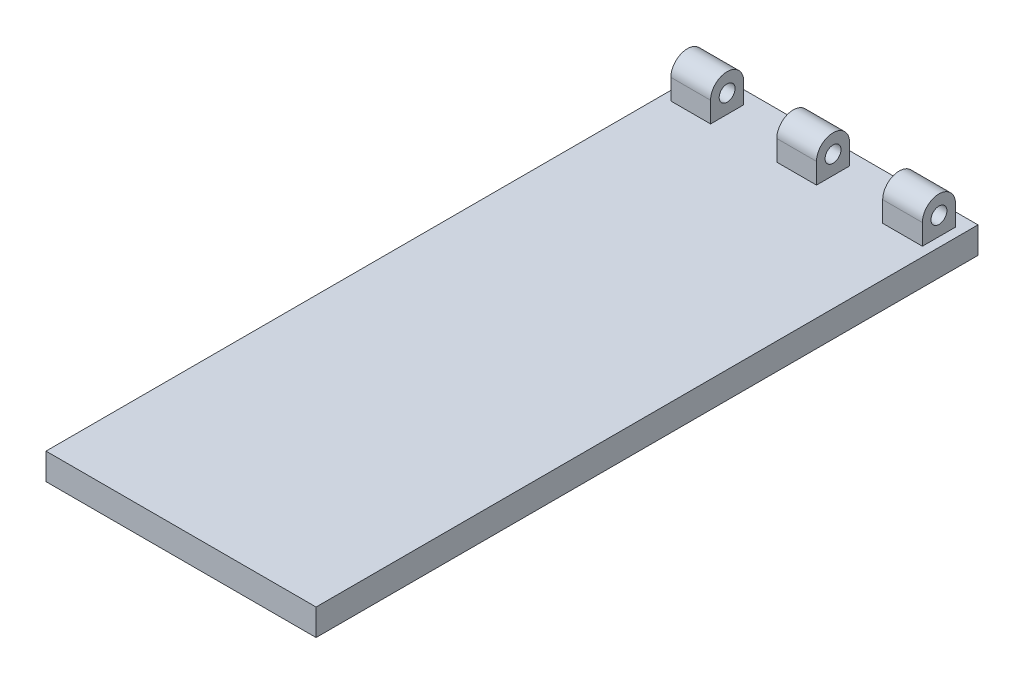
ISO-10303-21;
HEADER;
FILE_DESCRIPTION(('STEP AP214'),'2;1');
FILE_NAME('part.step','',(''),(''),'','','');
FILE_SCHEMA(('AUTOMOTIVE_DESIGN { 1 0 10303 214 1 1 1 1 }'));
ENDSEC;
DATA;
#1=APPLICATION_CONTEXT('core data for automotive mechanical design processes');
#2=APPLICATION_PROTOCOL_DEFINITION('international standard','automotive_design',2000,#1);
#3=PRODUCT_CONTEXT('',#1,'mechanical');
#4=PRODUCT('Part','Part','',(#3));
#5=PRODUCT_RELATED_PRODUCT_CATEGORY('part','',(#4));
#6=PRODUCT_DEFINITION_FORMATION('','',#4);
#7=PRODUCT_DEFINITION_CONTEXT('part definition',#1,'design');
#8=PRODUCT_DEFINITION('design','',#6,#7);
#9=PRODUCT_DEFINITION_SHAPE('','',#8);
#10=(LENGTH_UNIT() NAMED_UNIT(*) SI_UNIT(.MILLI.,.METRE.));
#11=(NAMED_UNIT(*) PLANE_ANGLE_UNIT() SI_UNIT($,.RADIAN.));
#12=(NAMED_UNIT(*) SI_UNIT($,.STERADIAN.) SOLID_ANGLE_UNIT());
#13=UNCERTAINTY_MEASURE_WITH_UNIT(LENGTH_MEASURE(1.E-05),#10,'distance_accuracy_value','');
#14=(GEOMETRIC_REPRESENTATION_CONTEXT(3) GLOBAL_UNCERTAINTY_ASSIGNED_CONTEXT((#13)) GLOBAL_UNIT_ASSIGNED_CONTEXT((#10,
#11,#12)) REPRESENTATION_CONTEXT('',''));
#15=CARTESIAN_POINT('',(0.,0.,0.));
#16=DIRECTION('',(0.,0.,1.));
#17=DIRECTION('',(1.,0.,0.));
#18=AXIS2_PLACEMENT_3D('',#15,#16,#17);
#19=CARTESIAN_POINT('',(47.5,17.75,-113.75));
#20=DIRECTION('',(1.,0.,0.));
#21=DIRECTION('',(0.,0.,-1.));
#22=AXIS2_PLACEMENT_3D('',#19,#20,#21);
#23=CYLINDRICAL_SURFACE('',#22,6.25);
#24=DIRECTION('',(-1.,0.,0.));
#25=VECTOR('',#24,1.);
#26=CARTESIAN_POINT('',(47.5,17.75,-120.));
#27=LINE('',#26,#25);
#28=CARTESIAN_POINT('',(-7.5,17.75,-120.));
#29=VERTEX_POINT('',#28);
#30=CARTESIAN_POINT('',(7.5,17.75,-120.));
#31=VERTEX_POINT('',#30);
#32=EDGE_CURVE('E239',#29,#31,#27,.F.);
#33=ORIENTED_EDGE('',*,*,#32,.F.);
#34=CARTESIAN_POINT('',(-7.5,17.75,-113.75));
#35=DIRECTION('',(-1.,0.,0.));
#36=DIRECTION('',(0.,0.,1.));
#37=AXIS2_PLACEMENT_3D('',#34,#35,#36);
#38=CIRCLE('',#37,6.25);
#39=CARTESIAN_POINT('',(-7.5,17.75,-107.5));
#40=VERTEX_POINT('',#39);
#41=EDGE_CURVE('E261',#29,#40,#38,.F.);
#42=ORIENTED_EDGE('',*,*,#41,.T.);
#43=DIRECTION('',(-1.,0.,0.));
#44=VECTOR('',#43,1.);
#45=CARTESIAN_POINT('',(47.5,17.75,-107.5));
#46=LINE('',#45,#44);
#47=CARTESIAN_POINT('',(7.5,17.75,-107.5));
#48=VERTEX_POINT('',#47);
#49=EDGE_CURVE('E173',#48,#40,#46,.T.);
#50=ORIENTED_EDGE('',*,*,#49,.F.);
#51=CARTESIAN_POINT('',(7.5,17.75,-113.75));
#52=DIRECTION('',(-1.,0.,0.));
#53=DIRECTION('',(0.,0.,1.));
#54=AXIS2_PLACEMENT_3D('',#51,#52,#53);
#55=CIRCLE('',#54,6.25);
#56=EDGE_CURVE('E243',#31,#48,#55,.F.);
#57=ORIENTED_EDGE('',*,*,#56,.F.);
#58=EDGE_LOOP('',(#33,#42,#50,#57));
#59=FACE_BOUND('',#58,.T.);
#60=ADVANCED_FACE('F40',(#59),#23,.T.);
#61=CARTESIAN_POINT('',(-32.5,17.75,-107.5));
#62=VERTEX_POINT('',#61);
#63=CARTESIAN_POINT('',(-47.5,17.75,-107.5));
#64=VERTEX_POINT('',#63);
#65=EDGE_CURVE('E226',#62,#64,#46,.T.);
#66=ORIENTED_EDGE('',*,*,#65,.F.);
#67=CARTESIAN_POINT('',(-32.5,17.75,-113.75));
#68=DIRECTION('',(1.,0.,0.));
#69=DIRECTION('',(0.,0.,-1.));
#70=AXIS2_PLACEMENT_3D('',#67,#68,#69);
#71=CIRCLE('',#70,6.25);
#72=CARTESIAN_POINT('',(-32.5,17.75,-120.));
#73=VERTEX_POINT('',#72);
#74=EDGE_CURVE('E249',#62,#73,#71,.F.);
#75=ORIENTED_EDGE('',*,*,#74,.T.);
#76=CARTESIAN_POINT('',(-47.5,17.75,-120.));
#77=VERTEX_POINT('',#76);
#78=EDGE_CURVE('E236',#77,#73,#27,.F.);
#79=ORIENTED_EDGE('',*,*,#78,.F.);
#80=CARTESIAN_POINT('',(-47.5,17.75,-113.75));
#81=DIRECTION('',(1.,0.,0.));
#82=DIRECTION('',(0.,0.,-1.));
#83=AXIS2_PLACEMENT_3D('',#80,#81,#82);
#84=CIRCLE('',#83,6.25);
#85=EDGE_CURVE('E11',#64,#77,#84,.F.);
#86=ORIENTED_EDGE('',*,*,#85,.F.);
#87=EDGE_LOOP('',(#66,#75,#79,#86));
#88=FACE_BOUND('',#87,.T.);
#89=ADVANCED_FACE('F290',(#88),#23,.T.);
#90=CARTESIAN_POINT('',(32.5,17.75,-113.75));
#91=DIRECTION('',(1.,0.,0.));
#92=DIRECTION('',(0.,0.,-1.));
#93=AXIS2_PLACEMENT_3D('',#90,#91,#92);
#94=CIRCLE('',#93,6.25);
#95=CARTESIAN_POINT('',(32.5,17.75,-107.5));
#96=VERTEX_POINT('',#95);
#97=CARTESIAN_POINT('',(32.5,17.75,-120.));
#98=VERTEX_POINT('',#97);
#99=EDGE_CURVE('E246',#96,#98,#94,.F.);
#100=ORIENTED_EDGE('',*,*,#99,.F.);
#101=CARTESIAN_POINT('',(47.5,17.75,-107.5));
#102=VERTEX_POINT('',#101);
#103=EDGE_CURVE('E232',#102,#96,#46,.T.);
#104=ORIENTED_EDGE('',*,*,#103,.F.);
#105=CARTESIAN_POINT('',(47.5,17.75,-113.75));
#106=DIRECTION('',(-1.,0.,0.));
#107=DIRECTION('',(0.,0.,1.));
#108=AXIS2_PLACEMENT_3D('',#105,#106,#107);
#109=CIRCLE('',#108,6.25);
#110=CARTESIAN_POINT('',(47.5,17.75,-120.));
#111=VERTEX_POINT('',#110);
#112=EDGE_CURVE('E49',#111,#102,#109,.F.);
#113=ORIENTED_EDGE('',*,*,#112,.F.);
#114=EDGE_CURVE('E235',#98,#111,#27,.F.);
#115=ORIENTED_EDGE('',*,*,#114,.F.);
#116=EDGE_LOOP('',(#100,#104,#113,#115));
#117=FACE_BOUND('',#116,.T.);
#118=ADVANCED_FACE('F324',(#117),#23,.T.);
#119=CARTESIAN_POINT('',(0.,24.,-120.));
#120=DIRECTION('',(0.,0.,1.));
#121=DIRECTION('',(1.,0.,0.));
#122=AXIS2_PLACEMENT_3D('',#119,#120,#121);
#123=PLANE('',#122);
#124=DIRECTION('',(0.,-1.,0.));
#125=VECTOR('',#124,1.);
#126=CARTESIAN_POINT('',(-7.5,26.,-120.));
#127=LINE('',#126,#125);
#128=CARTESIAN_POINT('',(-7.5,10.,-120.));
#129=VERTEX_POINT('',#128);
#130=EDGE_CURVE('E162',#29,#129,#127,.T.);
#131=ORIENTED_EDGE('',*,*,#130,.F.);
#132=ORIENTED_EDGE('',*,*,#32,.T.);
#133=DIRECTION('',(0.,-1.,0.));
#134=VECTOR('',#133,1.);
#135=CARTESIAN_POINT('',(7.5,26.,-120.));
#136=LINE('',#135,#134);
#137=CARTESIAN_POINT('',(7.5,10.,-120.));
#138=VERTEX_POINT('',#137);
#139=EDGE_CURVE('E306',#31,#138,#136,.T.);
#140=ORIENTED_EDGE('',*,*,#139,.T.);
#141=DIRECTION('',(-1.,0.,0.));
#142=VECTOR('',#141,1.);
#143=CARTESIAN_POINT('',(0.,10.,-120.));
#144=LINE('',#143,#142);
#145=EDGE_CURVE('E269',#138,#129,#144,.T.);
#146=ORIENTED_EDGE('',*,*,#145,.T.);
#147=EDGE_LOOP('',(#131,#132,#140,#146));
#148=FACE_BOUND('',#147,.T.);
#149=ADVANCED_FACE('F328',(#148),#123,.F.);
#150=DIRECTION('',(0.,-1.,0.));
#151=VECTOR('',#150,1.);
#152=CARTESIAN_POINT('',(-32.5,26.,-120.));
#153=LINE('',#152,#151);
#154=CARTESIAN_POINT('',(-32.5,10.,-120.));
#155=VERTEX_POINT('',#154);
#156=EDGE_CURVE('E277',#73,#155,#153,.T.);
#157=ORIENTED_EDGE('',*,*,#156,.T.);
#158=CARTESIAN_POINT('',(-47.5,10.,-120.));
#159=VERTEX_POINT('',#158);
#160=EDGE_CURVE('E266',#155,#159,#144,.T.);
#161=ORIENTED_EDGE('',*,*,#160,.T.);
#162=DIRECTION('',(0.,-1.,0.));
#163=VECTOR('',#162,1.);
#164=CARTESIAN_POINT('',(-47.5,24.,-120.));
#165=LINE('',#164,#163);
#166=EDGE_CURVE('E191',#77,#159,#165,.T.);
#167=ORIENTED_EDGE('',*,*,#166,.F.);
#168=ORIENTED_EDGE('',*,*,#78,.T.);
#169=EDGE_LOOP('',(#157,#161,#167,#168));
#170=FACE_BOUND('',#169,.T.);
#171=ADVANCED_FACE('F276',(#170),#123,.F.);
#172=CARTESIAN_POINT('',(47.5,10.,-120.));
#173=VERTEX_POINT('',#172);
#174=CARTESIAN_POINT('',(32.5,10.,-120.));
#175=VERTEX_POINT('',#174);
#176=EDGE_CURVE('E267',#173,#175,#144,.T.);
#177=ORIENTED_EDGE('',*,*,#176,.T.);
#178=DIRECTION('',(0.,-1.,0.));
#179=VECTOR('',#178,1.);
#180=CARTESIAN_POINT('',(32.5,26.,-120.));
#181=LINE('',#180,#179);
#182=EDGE_CURVE('E164',#98,#175,#181,.T.);
#183=ORIENTED_EDGE('',*,*,#182,.F.);
#184=ORIENTED_EDGE('',*,*,#114,.T.);
#185=DIRECTION('',(0.,-1.,0.));
#186=VECTOR('',#185,1.);
#187=CARTESIAN_POINT('',(47.5,24.,-120.));
#188=LINE('',#187,#186);
#189=EDGE_CURVE('E194',#111,#173,#188,.T.);
#190=ORIENTED_EDGE('',*,*,#189,.T.);
#191=EDGE_LOOP('',(#177,#183,#184,#190));
#192=FACE_BOUND('',#191,.T.);
#193=ADVANCED_FACE('F361',(#192),#123,.F.);
#194=CARTESIAN_POINT('',(0.,24.,-107.5));
#195=DIRECTION('',(0.,0.,-1.));
#196=DIRECTION('',(-1.,0.,0.));
#197=AXIS2_PLACEMENT_3D('',#194,#195,#196);
#198=PLANE('',#197);
#199=DIRECTION('',(0.,-1.,0.));
#200=VECTOR('',#199,1.);
#201=CARTESIAN_POINT('',(-7.5,26.,-107.5));
#202=LINE('',#201,#200);
#203=CARTESIAN_POINT('',(-7.5,10.,-107.5));
#204=VERTEX_POINT('',#203);
#205=EDGE_CURVE('E159',#40,#204,#202,.T.);
#206=ORIENTED_EDGE('',*,*,#205,.T.);
#207=DIRECTION('',(1.,0.,0.));
#208=VECTOR('',#207,1.);
#209=CARTESIAN_POINT('',(0.,10.,-107.5));
#210=LINE('',#209,#208);
#211=CARTESIAN_POINT('',(7.5,10.,-107.5));
#212=VERTEX_POINT('',#211);
#213=EDGE_CURVE('E171',#204,#212,#210,.T.);
#214=ORIENTED_EDGE('',*,*,#213,.T.);
#215=DIRECTION('',(0.,-1.,0.));
#216=VECTOR('',#215,1.);
#217=CARTESIAN_POINT('',(7.5,26.,-107.5));
#218=LINE('',#217,#216);
#219=EDGE_CURVE('E304',#48,#212,#218,.T.);
#220=ORIENTED_EDGE('',*,*,#219,.F.);
#221=ORIENTED_EDGE('',*,*,#49,.T.);
#222=EDGE_LOOP('',(#206,#214,#220,#221));
#223=FACE_BOUND('',#222,.T.);
#224=ADVANCED_FACE('F169',(#223),#198,.F.);
#225=DIRECTION('',(0.,-1.,0.));
#226=VECTOR('',#225,1.);
#227=CARTESIAN_POINT('',(-32.5,26.,-107.5));
#228=LINE('',#227,#226);
#229=CARTESIAN_POINT('',(-32.5,10.,-107.5));
#230=VERTEX_POINT('',#229);
#231=EDGE_CURVE('E287',#62,#230,#228,.T.);
#232=ORIENTED_EDGE('',*,*,#231,.F.);
#233=ORIENTED_EDGE('',*,*,#65,.T.);
#234=DIRECTION('',(0.,-1.,0.));
#235=VECTOR('',#234,1.);
#236=CARTESIAN_POINT('',(-47.5,24.,-107.5));
#237=LINE('',#236,#235);
#238=CARTESIAN_POINT('',(-47.5,10.,-107.5));
#239=VERTEX_POINT('',#238);
#240=EDGE_CURVE('E189',#64,#239,#237,.T.);
#241=ORIENTED_EDGE('',*,*,#240,.T.);
#242=EDGE_CURVE('E178',#239,#230,#210,.T.);
#243=ORIENTED_EDGE('',*,*,#242,.T.);
#244=EDGE_LOOP('',(#232,#233,#241,#243));
#245=FACE_BOUND('',#244,.T.);
#246=ADVANCED_FACE('F286',(#245),#198,.F.);
#247=ORIENTED_EDGE('',*,*,#103,.T.);
#248=DIRECTION('',(0.,-1.,0.));
#249=VECTOR('',#248,1.);
#250=CARTESIAN_POINT('',(32.5,26.,-107.5));
#251=LINE('',#250,#249);
#252=CARTESIAN_POINT('',(32.5,10.,-107.5));
#253=VERTEX_POINT('',#252);
#254=EDGE_CURVE('E301',#96,#253,#251,.T.);
#255=ORIENTED_EDGE('',*,*,#254,.T.);
#256=CARTESIAN_POINT('',(47.5,10.,-107.5));
#257=VERTEX_POINT('',#256);
#258=EDGE_CURVE('E179',#253,#257,#210,.T.);
#259=ORIENTED_EDGE('',*,*,#258,.T.);
#260=DIRECTION('',(0.,-1.,0.));
#261=VECTOR('',#260,1.);
#262=CARTESIAN_POINT('',(47.5,24.,-107.5));
#263=LINE('',#262,#261);
#264=EDGE_CURVE('E182',#102,#257,#263,.T.);
#265=ORIENTED_EDGE('',*,*,#264,.F.);
#266=EDGE_LOOP('',(#247,#255,#259,#265));
#267=FACE_BOUND('',#266,.T.);
#268=ADVANCED_FACE('F317',(#267),#198,.F.);
#269=CARTESIAN_POINT('',(-51.,17.,-113.75));
#270=DIRECTION('',(1.,0.,0.));
#271=DIRECTION('',(0.,0.,-1.));
#272=AXIS2_PLACEMENT_3D('',#269,#270,#271);
#273=CYLINDRICAL_SURFACE('',#272,3.00000000000001);
#274=CARTESIAN_POINT('',(-47.5,17.,-113.75));
#275=DIRECTION('',(1.,0.,0.));
#276=DIRECTION('',(0.,0.,-1.));
#277=AXIS2_PLACEMENT_3D('',#274,#275,#276);
#278=CIRCLE('',#277,3.00000000000001);
#279=CARTESIAN_POINT('',(-47.5,17.,-116.75));
#280=VERTEX_POINT('',#279);
#281=EDGE_CURVE('E227',#280,#280,#278,.T.);
#282=CARTESIAN_POINT('',(-32.5,17.,-113.75));
#283=DIRECTION('',(1.,0.,0.));
#284=DIRECTION('',(0.,0.,-1.));
#285=AXIS2_PLACEMENT_3D('',#282,#283,#284);
#286=CIRCLE('',#285,3.00000000000001);
#287=CARTESIAN_POINT('',(-32.5,17.,-116.75));
#288=VERTEX_POINT('',#287);
#289=EDGE_CURVE('E247',#288,#288,#286,.F.);
#290=CARTESIAN_POINT('',(-47.5,17.,-116.75));
#291=CARTESIAN_POINT('',(-47.34375,17.,-116.75));
#292=CARTESIAN_POINT('',(-47.1875,17.,-116.75));
#293=CARTESIAN_POINT('',(-46.875,17.,-116.75));
#294=CARTESIAN_POINT('',(-46.71875,17.,-116.75));
#295=CARTESIAN_POINT('',(-46.40625,17.,-116.75));
#296=CARTESIAN_POINT('',(-46.25,17.,-116.75));
#297=CARTESIAN_POINT('',(-45.9375,17.,-116.75));
#298=CARTESIAN_POINT('',(-45.78125,17.,-116.75));
#299=CARTESIAN_POINT('',(-45.46875,17.,-116.75));
#300=CARTESIAN_POINT('',(-45.3125,17.,-116.75));
#301=CARTESIAN_POINT('',(-45.,17.,-116.75));
#302=CARTESIAN_POINT('',(-44.84375,17.,-116.75));
#303=CARTESIAN_POINT('',(-44.53125,17.,-116.75));
#304=CARTESIAN_POINT('',(-44.375,17.,-116.75));
#305=CARTESIAN_POINT('',(-44.0625,17.,-116.75));
#306=CARTESIAN_POINT('',(-43.90625,17.,-116.75));
#307=CARTESIAN_POINT('',(-43.59375,17.,-116.75));
#308=CARTESIAN_POINT('',(-43.4375,17.,-116.75));
#309=CARTESIAN_POINT('',(-43.125,17.,-116.75));
#310=CARTESIAN_POINT('',(-42.96875,17.,-116.75));
#311=CARTESIAN_POINT('',(-42.65625,17.,-116.75));
#312=CARTESIAN_POINT('',(-42.5,17.,-116.75));
#313=CARTESIAN_POINT('',(-42.1875,17.,-116.75));
#314=CARTESIAN_POINT('',(-42.03125,17.,-116.75));
#315=CARTESIAN_POINT('',(-41.71875,17.,-116.75));
#316=CARTESIAN_POINT('',(-41.5625,17.,-116.75));
#317=CARTESIAN_POINT('',(-41.25,17.,-116.75));
#318=CARTESIAN_POINT('',(-41.09375,17.,-116.75));
#319=CARTESIAN_POINT('',(-40.78125,17.,-116.75));
#320=CARTESIAN_POINT('',(-40.625,17.,-116.75));
#321=CARTESIAN_POINT('',(-40.3125,17.,-116.75));
#322=CARTESIAN_POINT('',(-40.15625,17.,-116.75));
#323=CARTESIAN_POINT('',(-39.84375,17.,-116.75));
#324=CARTESIAN_POINT('',(-39.6875,17.,-116.75));
#325=CARTESIAN_POINT('',(-39.375,17.,-116.75));
#326=CARTESIAN_POINT('',(-39.21875,17.,-116.75));
#327=CARTESIAN_POINT('',(-38.90625,17.,-116.75));
#328=CARTESIAN_POINT('',(-38.75,17.,-116.75));
#329=CARTESIAN_POINT('',(-38.4375,17.,-116.75));
#330=CARTESIAN_POINT('',(-38.28125,17.,-116.75));
#331=CARTESIAN_POINT('',(-37.96875,17.,-116.75));
#332=CARTESIAN_POINT('',(-37.8125,17.,-116.75));
#333=CARTESIAN_POINT('',(-37.5,17.,-116.75));
#334=CARTESIAN_POINT('',(-37.34375,17.,-116.75));
#335=CARTESIAN_POINT('',(-37.03125,17.,-116.75));
#336=CARTESIAN_POINT('',(-36.875,17.,-116.75));
#337=CARTESIAN_POINT('',(-36.5625,17.,-116.75));
#338=CARTESIAN_POINT('',(-36.40625,17.,-116.75));
#339=CARTESIAN_POINT('',(-36.09375,17.,-116.75));
#340=CARTESIAN_POINT('',(-35.9375,17.,-116.75));
#341=CARTESIAN_POINT('',(-35.625,17.,-116.75));
#342=CARTESIAN_POINT('',(-35.46875,17.,-116.75));
#343=CARTESIAN_POINT('',(-35.15625,17.,-116.75));
#344=CARTESIAN_POINT('',(-35.,17.,-116.75));
#345=CARTESIAN_POINT('',(-34.6875,17.,-116.75));
#346=CARTESIAN_POINT('',(-34.53125,17.,-116.75));
#347=CARTESIAN_POINT('',(-34.21875,17.,-116.75));
#348=CARTESIAN_POINT('',(-34.0625,17.,-116.75));
#349=CARTESIAN_POINT('',(-33.75,17.,-116.75));
#350=CARTESIAN_POINT('',(-33.59375,17.,-116.75));
#351=CARTESIAN_POINT('',(-33.28125,17.,-116.75));
#352=CARTESIAN_POINT('',(-33.125,17.,-116.75));
#353=CARTESIAN_POINT('',(-32.8125,17.,-116.75));
#354=CARTESIAN_POINT('',(-32.65625,17.,-116.75));
#355=CARTESIAN_POINT('',(-32.5,17.,-116.75));
#356=B_SPLINE_CURVE_WITH_KNOTS('',3,(#290,#291,#292,#293,#294,#295,#296,#297,#298,#299,#300,
#301,#302,#303,#304,#305,#306,#307,#308,#309,#310,#311,#312,#313,#314,#315,#316,#317,#318,#319,
#320,#321,#322,#323,#324,#325,#326,#327,#328,#329,#330,#331,#332,#333,#334,#335,#336,#337,#338,
#339,#340,#341,#342,#343,#344,#345,#346,#347,#348,#349,#350,#351,#352,#353,#354,#355),
.UNSPECIFIED.,.F.,.F.,(4,2,2,2,2,2,2,2,2,2,2,2,2,2,2,2,2,2,2,2,2,2,2,2,2,2,2,2,2,2,2,2,4),(0.,
0.468750000000004,0.937500000000001,1.40625,1.875,2.34375000000001,2.8125,3.28125000000001,3.75,
4.21875,4.6875,5.15625,5.62500000000001,6.09375,6.56250000000001,7.03125,7.5,7.96875,
8.43750000000001,8.90625,9.375,9.84375000000001,10.3125,10.78125,11.25,11.71875,12.1875,
12.65625,13.125,13.59375,14.0625,14.53125,15.),.UNSPECIFIED.);
#357=EDGE_CURVE('BSEAM342',#280,#288,#356,.T.);
#358=ORIENTED_EDGE('',*,*,#281,.F.);
#359=ORIENTED_EDGE('',*,*,#289,.F.);
#360=ORIENTED_EDGE('',*,*,#357,.T.);
#361=ORIENTED_EDGE('',*,*,#357,.F.);
#362=EDGE_LOOP('',(#358,#360,#359,#361));
#363=FACE_BOUND('',#362,.T.);
#364=ADVANCED_FACE('F342',(#363),#273,.F.);
#365=CARTESIAN_POINT('',(32.5,17.,-113.75));
#366=DIRECTION('',(1.,0.,0.));
#367=DIRECTION('',(0.,0.,-1.));
#368=AXIS2_PLACEMENT_3D('',#365,#366,#367);
#369=CIRCLE('',#368,3.00000000000001);
#370=CARTESIAN_POINT('',(32.5,17.,-116.75));
#371=VERTEX_POINT('',#370);
#372=EDGE_CURVE('E244',#371,#371,#369,.F.);
#373=CARTESIAN_POINT('',(47.5,17.,-113.75));
#374=DIRECTION('',(1.,0.,0.));
#375=DIRECTION('',(0.,0.,-1.));
#376=AXIS2_PLACEMENT_3D('',#373,#374,#375);
#377=CIRCLE('',#376,3.00000000000001);
#378=CARTESIAN_POINT('',(47.5,17.,-116.75));
#379=VERTEX_POINT('',#378);
#380=EDGE_CURVE('E231',#379,#379,#377,.T.);
#381=CARTESIAN_POINT('',(32.5,17.,-116.75));
#382=CARTESIAN_POINT('',(32.65625,17.,-116.75));
#383=CARTESIAN_POINT('',(32.8125,17.,-116.75));
#384=CARTESIAN_POINT('',(33.125,17.,-116.75));
#385=CARTESIAN_POINT('',(33.28125,17.,-116.75));
#386=CARTESIAN_POINT('',(33.59375,17.,-116.75));
#387=CARTESIAN_POINT('',(33.75,17.,-116.75));
#388=CARTESIAN_POINT('',(34.0625,17.,-116.75));
#389=CARTESIAN_POINT('',(34.21875,17.,-116.75));
#390=CARTESIAN_POINT('',(34.53125,17.,-116.75));
#391=CARTESIAN_POINT('',(34.6875,17.,-116.75));
#392=CARTESIAN_POINT('',(35.,17.,-116.75));
#393=CARTESIAN_POINT('',(35.15625,17.,-116.75));
#394=CARTESIAN_POINT('',(35.46875,17.,-116.75));
#395=CARTESIAN_POINT('',(35.625,17.,-116.75));
#396=CARTESIAN_POINT('',(35.9375,17.,-116.75));
#397=CARTESIAN_POINT('',(36.09375,17.,-116.75));
#398=CARTESIAN_POINT('',(36.40625,17.,-116.75));
#399=CARTESIAN_POINT('',(36.5625,17.,-116.75));
#400=CARTESIAN_POINT('',(36.875,17.,-116.75));
#401=CARTESIAN_POINT('',(37.03125,17.,-116.75));
#402=CARTESIAN_POINT('',(37.34375,17.,-116.75));
#403=CARTESIAN_POINT('',(37.5,17.,-116.75));
#404=CARTESIAN_POINT('',(37.8125,17.,-116.75));
#405=CARTESIAN_POINT('',(37.96875,17.,-116.75));
#406=CARTESIAN_POINT('',(38.28125,17.,-116.75));
#407=CARTESIAN_POINT('',(38.4375,17.,-116.75));
#408=CARTESIAN_POINT('',(38.75,17.,-116.75));
#409=CARTESIAN_POINT('',(38.90625,17.,-116.75));
#410=CARTESIAN_POINT('',(39.21875,17.,-116.75));
#411=CARTESIAN_POINT('',(39.375,17.,-116.75));
#412=CARTESIAN_POINT('',(39.6875,17.,-116.75));
#413=CARTESIAN_POINT('',(39.84375,17.,-116.75));
#414=CARTESIAN_POINT('',(40.15625,17.,-116.75));
#415=CARTESIAN_POINT('',(40.3125,17.,-116.75));
#416=CARTESIAN_POINT('',(40.625,17.,-116.75));
#417=CARTESIAN_POINT('',(40.78125,17.,-116.75));
#418=CARTESIAN_POINT('',(41.09375,17.,-116.75));
#419=CARTESIAN_POINT('',(41.25,17.,-116.75));
#420=CARTESIAN_POINT('',(41.5625,17.,-116.75));
#421=CARTESIAN_POINT('',(41.71875,17.,-116.75));
#422=CARTESIAN_POINT('',(42.03125,17.,-116.75));
#423=CARTESIAN_POINT('',(42.1875,17.,-116.75));
#424=CARTESIAN_POINT('',(42.5,17.,-116.75));
#425=CARTESIAN_POINT('',(42.65625,17.,-116.75));
#426=CARTESIAN_POINT('',(42.96875,17.,-116.75));
#427=CARTESIAN_POINT('',(43.125,17.,-116.75));
#428=CARTESIAN_POINT('',(43.4375,17.,-116.75));
#429=CARTESIAN_POINT('',(43.59375,17.,-116.75));
#430=CARTESIAN_POINT('',(43.90625,17.,-116.75));
#431=CARTESIAN_POINT('',(44.0625,17.,-116.75));
#432=CARTESIAN_POINT('',(44.375,17.,-116.75));
#433=CARTESIAN_POINT('',(44.53125,17.,-116.75));
#434=CARTESIAN_POINT('',(44.84375,17.,-116.75));
#435=CARTESIAN_POINT('',(45.,17.,-116.75));
#436=CARTESIAN_POINT('',(45.3125,17.,-116.75));
#437=CARTESIAN_POINT('',(45.46875,17.,-116.75));
#438=CARTESIAN_POINT('',(45.78125,17.,-116.75));
#439=CARTESIAN_POINT('',(45.9375,17.,-116.75));
#440=CARTESIAN_POINT('',(46.25,17.,-116.75));
#441=CARTESIAN_POINT('',(46.40625,17.,-116.75));
#442=CARTESIAN_POINT('',(46.71875,17.,-116.75));
#443=CARTESIAN_POINT('',(46.875,17.,-116.75));
#444=CARTESIAN_POINT('',(47.1875,17.,-116.75));
#445=CARTESIAN_POINT('',(47.34375,17.,-116.75));
#446=CARTESIAN_POINT('',(47.5,17.,-116.75));
#447=B_SPLINE_CURVE_WITH_KNOTS('',3,(#381,#382,#383,#384,#385,#386,#387,#388,#389,#390,#391,
#392,#393,#394,#395,#396,#397,#398,#399,#400,#401,#402,#403,#404,#405,#406,#407,#408,#409,#410,
#411,#412,#413,#414,#415,#416,#417,#418,#419,#420,#421,#422,#423,#424,#425,#426,#427,#428,#429,
#430,#431,#432,#433,#434,#435,#436,#437,#438,#439,#440,#441,#442,#443,#444,#445,#446),
.UNSPECIFIED.,.F.,.F.,(4,2,2,2,2,2,2,2,2,2,2,2,2,2,2,2,2,2,2,2,2,2,2,2,2,2,2,2,2,2,2,2,4),(0.,
0.468750000000004,0.937500000000008,1.40625,1.875,2.34375000000001,2.8125,3.28125,3.75,
4.21875000000001,4.68750000000001,5.15625,5.62500000000001,6.09375000000001,6.5625,7.03125,
7.50000000000001,7.96875000000001,8.43750000000001,8.90625,9.37500000000001,9.84375000000001,
10.3125,10.78125,11.25,11.71875,12.1875,12.65625,13.125,13.59375,14.0625,14.53125,15.),.UNSPECIFIED.);
#448=EDGE_CURVE('BSEAM343',#371,#379,#447,.T.);
#449=ORIENTED_EDGE('',*,*,#372,.T.);
#450=ORIENTED_EDGE('',*,*,#380,.T.);
#451=ORIENTED_EDGE('',*,*,#448,.T.);
#452=ORIENTED_EDGE('',*,*,#448,.F.);
#453=EDGE_LOOP('',(#449,#451,#450,#452));
#454=FACE_BOUND('',#453,.T.);
#455=ADVANCED_FACE('F343',(#454),#273,.F.);
#456=CARTESIAN_POINT('',(0.,10.,0.));
#457=DIRECTION('',(0.,1.,0.));
#458=DIRECTION('',(0.,0.,1.));
#459=AXIS2_PLACEMENT_3D('',#456,#457,#458);
#460=PLANE('',#459);
#461=DIRECTION('',(0.,0.,-1.));
#462=VECTOR('',#461,1.);
#463=CARTESIAN_POINT('',(-7.5,10.,0.));
#464=LINE('',#463,#462);
#465=EDGE_CURVE('E155',#204,#129,#464,.T.);
#466=ORIENTED_EDGE('',*,*,#465,.T.);
#467=ORIENTED_EDGE('',*,*,#145,.F.);
#468=DIRECTION('',(0.,0.,-1.));
#469=VECTOR('',#468,1.);
#470=CARTESIAN_POINT('',(7.49999999999999,10.,0.));
#471=LINE('',#470,#469);
#472=EDGE_CURVE('E57',#212,#138,#471,.T.);
#473=ORIENTED_EDGE('',*,*,#472,.F.);
#474=ORIENTED_EDGE('',*,*,#213,.F.);
#475=EDGE_LOOP('',(#466,#467,#473,#474));
#476=FACE_BOUND('',#475,.T.);
#477=DIRECTION('',(0.,0.,1.));
#478=VECTOR('',#477,1.);
#479=CARTESIAN_POINT('',(32.5,10.,0.));
#480=LINE('',#479,#478);
#481=EDGE_CURVE('E298',#175,#253,#480,.T.);
#482=ORIENTED_EDGE('',*,*,#481,.F.);
#483=ORIENTED_EDGE('',*,*,#176,.F.);
#484=DIRECTION('',(0.,0.,-1.));
#485=VECTOR('',#484,1.);
#486=CARTESIAN_POINT('',(47.5,10.,0.));
#487=LINE('',#486,#485);
#488=EDGE_CURVE('E230',#257,#173,#487,.T.);
#489=ORIENTED_EDGE('',*,*,#488,.F.);
#490=ORIENTED_EDGE('',*,*,#258,.F.);
#491=EDGE_LOOP('',(#482,#483,#489,#490));
#492=FACE_BOUND('',#491,.T.);
#493=DIRECTION('',(0.,0.,1.));
#494=VECTOR('',#493,1.);
#495=CARTESIAN_POINT('',(-51.,10.,125.));
#496=LINE('',#495,#494);
#497=CARTESIAN_POINT('',(-51.,10.,-125.));
#498=VERTEX_POINT('',#497);
#499=CARTESIAN_POINT('',(-51.,10.,125.));
#500=VERTEX_POINT('',#499);
#501=EDGE_CURVE('E197',#498,#500,#496,.T.);
#502=ORIENTED_EDGE('',*,*,#501,.T.);
#503=DIRECTION('',(1.,0.,0.));
#504=VECTOR('',#503,1.);
#505=CARTESIAN_POINT('',(51.,10.,125.));
#506=LINE('',#505,#504);
#507=CARTESIAN_POINT('',(51.,10.,125.));
#508=VERTEX_POINT('',#507);
#509=EDGE_CURVE('E200',#500,#508,#506,.T.);
#510=ORIENTED_EDGE('',*,*,#509,.T.);
#511=DIRECTION('',(0.,0.,-1.));
#512=VECTOR('',#511,1.);
#513=CARTESIAN_POINT('',(51.,10.,125.));
#514=LINE('',#513,#512);
#515=CARTESIAN_POINT('',(51.,10.,-125.));
#516=VERTEX_POINT('',#515);
#517=EDGE_CURVE('E203',#508,#516,#514,.T.);
#518=ORIENTED_EDGE('',*,*,#517,.T.);
#519=DIRECTION('',(-1.,0.,0.));
#520=VECTOR('',#519,1.);
#521=CARTESIAN_POINT('',(51.,10.,-125.));
#522=LINE('',#521,#520);
#523=EDGE_CURVE('E205',#516,#498,#522,.T.);
#524=ORIENTED_EDGE('',*,*,#523,.T.);
#525=EDGE_LOOP('',(#502,#510,#518,#524));
#526=FACE_BOUND('',#525,.T.);
#527=ORIENTED_EDGE('',*,*,#160,.F.);
#528=DIRECTION('',(0.,0.,1.));
#529=VECTOR('',#528,1.);
#530=CARTESIAN_POINT('',(-32.5,10.,0.));
#531=LINE('',#530,#529);
#532=EDGE_CURVE('E65',#155,#230,#531,.T.);
#533=ORIENTED_EDGE('',*,*,#532,.T.);
#534=ORIENTED_EDGE('',*,*,#242,.F.);
#535=DIRECTION('',(0.,0.,1.));
#536=VECTOR('',#535,1.);
#537=CARTESIAN_POINT('',(-47.5,10.,0.));
#538=LINE('',#537,#536);
#539=EDGE_CURVE('E183',#159,#239,#538,.T.);
#540=ORIENTED_EDGE('',*,*,#539,.F.);
#541=EDGE_LOOP('',(#527,#533,#534,#540));
#542=FACE_BOUND('',#541,.T.);
#543=ADVANCED_FACE('F176',(#476,#492,#526,#542),#460,.T.);
#544=CARTESIAN_POINT('',(-51.,10.,125.));
#545=DIRECTION('',(1.,0.,0.));
#546=DIRECTION('',(0.,0.,-1.));
#547=AXIS2_PLACEMENT_3D('',#544,#545,#546);
#548=PLANE('',#547);
#549=DIRECTION('',(0.,0.,1.));
#550=VECTOR('',#549,1.);
#551=CARTESIAN_POINT('',(-51.,0.,125.));
#552=LINE('',#551,#550);
#553=CARTESIAN_POINT('',(-51.,0.,-125.));
#554=VERTEX_POINT('',#553);
#555=CARTESIAN_POINT('',(-51.,0.,125.));
#556=VERTEX_POINT('',#555);
#557=EDGE_CURVE('E196',#554,#556,#552,.T.);
#558=ORIENTED_EDGE('',*,*,#557,.T.);
#559=DIRECTION('',(0.,-1.,0.));
#560=VECTOR('',#559,1.);
#561=CARTESIAN_POINT('',(-51.,10.,125.));
#562=LINE('',#561,#560);
#563=EDGE_CURVE('E223',#500,#556,#562,.T.);
#564=ORIENTED_EDGE('',*,*,#563,.F.);
#565=ORIENTED_EDGE('',*,*,#501,.F.);
#566=DIRECTION('',(0.,-1.,0.));
#567=VECTOR('',#566,1.);
#568=CARTESIAN_POINT('',(-51.,10.,-125.));
#569=LINE('',#568,#567);
#570=EDGE_CURVE('E207',#498,#554,#569,.T.);
#571=ORIENTED_EDGE('',*,*,#570,.T.);
#572=EDGE_LOOP('',(#558,#564,#565,#571));
#573=FACE_BOUND('',#572,.T.);
#574=ADVANCED_FACE('F406',(#573),#548,.F.);
#575=CARTESIAN_POINT('',(51.,10.,125.));
#576=DIRECTION('',(0.,0.,-1.));
#577=DIRECTION('',(-1.,0.,0.));
#578=AXIS2_PLACEMENT_3D('',#575,#576,#577);
#579=PLANE('',#578);
#580=DIRECTION('',(1.,0.,0.));
#581=VECTOR('',#580,1.);
#582=CARTESIAN_POINT('',(51.,0.,125.));
#583=LINE('',#582,#581);
#584=CARTESIAN_POINT('',(51.,0.,125.));
#585=VERTEX_POINT('',#584);
#586=EDGE_CURVE('E210',#556,#585,#583,.T.);
#587=ORIENTED_EDGE('',*,*,#586,.T.);
#588=DIRECTION('',(0.,-1.,0.));
#589=VECTOR('',#588,1.);
#590=CARTESIAN_POINT('',(51.,10.,125.));
#591=LINE('',#590,#589);
#592=EDGE_CURVE('E220',#508,#585,#591,.T.);
#593=ORIENTED_EDGE('',*,*,#592,.F.);
#594=ORIENTED_EDGE('',*,*,#509,.F.);
#595=ORIENTED_EDGE('',*,*,#563,.T.);
#596=EDGE_LOOP('',(#587,#593,#594,#595));
#597=FACE_BOUND('',#596,.T.);
#598=ADVANCED_FACE('F414',(#597),#579,.F.);
#599=CARTESIAN_POINT('',(51.,10.,125.));
#600=DIRECTION('',(-1.,0.,0.));
#601=DIRECTION('',(0.,0.,1.));
#602=AXIS2_PLACEMENT_3D('',#599,#600,#601);
#603=PLANE('',#602);
#604=DIRECTION('',(0.,0.,-1.));
#605=VECTOR('',#604,1.);
#606=CARTESIAN_POINT('',(51.,0.,125.));
#607=LINE('',#606,#605);
#608=CARTESIAN_POINT('',(51.,0.,-125.));
#609=VERTEX_POINT('',#608);
#610=EDGE_CURVE('E212',#585,#609,#607,.T.);
#611=ORIENTED_EDGE('',*,*,#610,.T.);
#612=DIRECTION('',(0.,-1.,0.));
#613=VECTOR('',#612,1.);
#614=CARTESIAN_POINT('',(51.,10.,-125.));
#615=LINE('',#614,#613);
#616=EDGE_CURVE('E217',#516,#609,#615,.T.);
#617=ORIENTED_EDGE('',*,*,#616,.F.);
#618=ORIENTED_EDGE('',*,*,#517,.F.);
#619=ORIENTED_EDGE('',*,*,#592,.T.);
#620=EDGE_LOOP('',(#611,#617,#618,#619));
#621=FACE_BOUND('',#620,.T.);
#622=ADVANCED_FACE('F410',(#621),#603,.F.);
#623=CARTESIAN_POINT('',(51.,10.,-125.));
#624=DIRECTION('',(0.,0.,1.));
#625=DIRECTION('',(1.,0.,0.));
#626=AXIS2_PLACEMENT_3D('',#623,#624,#625);
#627=PLANE('',#626);
#628=DIRECTION('',(-1.,0.,0.));
#629=VECTOR('',#628,1.);
#630=CARTESIAN_POINT('',(51.,0.,-125.));
#631=LINE('',#630,#629);
#632=EDGE_CURVE('E201',#609,#554,#631,.T.);
#633=ORIENTED_EDGE('',*,*,#632,.T.);
#634=ORIENTED_EDGE('',*,*,#570,.F.);
#635=ORIENTED_EDGE('',*,*,#523,.F.);
#636=ORIENTED_EDGE('',*,*,#616,.T.);
#637=EDGE_LOOP('',(#633,#634,#635,#636));
#638=FACE_BOUND('',#637,.T.);
#639=ADVANCED_FACE('F400',(#638),#627,.F.);
#640=CARTESIAN_POINT('',(0.,0.,0.));
#641=DIRECTION('',(0.,1.,0.));
#642=DIRECTION('',(0.,0.,1.));
#643=AXIS2_PLACEMENT_3D('',#640,#641,#642);
#644=PLANE('',#643);
#645=ORIENTED_EDGE('',*,*,#557,.F.);
#646=ORIENTED_EDGE('',*,*,#632,.F.);
#647=ORIENTED_EDGE('',*,*,#610,.F.);
#648=ORIENTED_EDGE('',*,*,#586,.F.);
#649=EDGE_LOOP('',(#645,#646,#647,#648));
#650=FACE_BOUND('',#649,.T.);
#651=ADVANCED_FACE('F395',(#650),#644,.F.);
#652=CARTESIAN_POINT('',(47.5,24.,0.));
#653=DIRECTION('',(-1.,0.,0.));
#654=DIRECTION('',(0.,0.,1.));
#655=AXIS2_PLACEMENT_3D('',#652,#653,#654);
#656=PLANE('',#655);
#657=ORIENTED_EDGE('',*,*,#380,.F.);
#658=EDGE_LOOP('',(#657));
#659=FACE_BOUND('',#658,.T.);
#660=ORIENTED_EDGE('',*,*,#189,.F.);
#661=ORIENTED_EDGE('',*,*,#112,.T.);
#662=ORIENTED_EDGE('',*,*,#264,.T.);
#663=ORIENTED_EDGE('',*,*,#488,.T.);
#664=EDGE_LOOP('',(#660,#661,#662,#663));
#665=FACE_BOUND('',#664,.T.);
#666=ADVANCED_FACE('F320',(#659,#665),#656,.F.);
#667=CARTESIAN_POINT('',(-47.5,24.,0.));
#668=DIRECTION('',(1.,0.,0.));
#669=DIRECTION('',(0.,0.,-1.));
#670=AXIS2_PLACEMENT_3D('',#667,#668,#669);
#671=PLANE('',#670);
#672=ORIENTED_EDGE('',*,*,#281,.T.);
#673=EDGE_LOOP('',(#672));
#674=FACE_BOUND('',#673,.T.);
#675=ORIENTED_EDGE('',*,*,#240,.F.);
#676=ORIENTED_EDGE('',*,*,#85,.T.);
#677=ORIENTED_EDGE('',*,*,#166,.T.);
#678=ORIENTED_EDGE('',*,*,#539,.T.);
#679=EDGE_LOOP('',(#675,#676,#677,#678));
#680=FACE_BOUND('',#679,.T.);
#681=ADVANCED_FACE('F281',(#674,#680),#671,.F.);
#682=CARTESIAN_POINT('',(32.5,26.,0.));
#683=DIRECTION('',(1.,0.,0.));
#684=DIRECTION('',(0.,0.,-1.));
#685=AXIS2_PLACEMENT_3D('',#682,#683,#684);
#686=PLANE('',#685);
#687=ORIENTED_EDGE('',*,*,#99,.T.);
#688=ORIENTED_EDGE('',*,*,#182,.T.);
#689=ORIENTED_EDGE('',*,*,#481,.T.);
#690=ORIENTED_EDGE('',*,*,#254,.F.);
#691=EDGE_LOOP('',(#687,#688,#689,#690));
#692=FACE_BOUND('',#691,.T.);
#693=ORIENTED_EDGE('',*,*,#372,.F.);
#694=EDGE_LOOP('',(#693));
#695=FACE_BOUND('',#694,.T.);
#696=ADVANCED_FACE('F309',(#692,#695),#686,.F.);
#697=CARTESIAN_POINT('',(7.49999999999999,26.,0.));
#698=DIRECTION('',(-1.,0.,0.));
#699=DIRECTION('',(0.,0.,1.));
#700=AXIS2_PLACEMENT_3D('',#697,#698,#699);
#701=PLANE('',#700);
#702=ORIENTED_EDGE('',*,*,#56,.T.);
#703=ORIENTED_EDGE('',*,*,#219,.T.);
#704=ORIENTED_EDGE('',*,*,#472,.T.);
#705=ORIENTED_EDGE('',*,*,#139,.F.);
#706=EDGE_LOOP('',(#702,#703,#704,#705));
#707=FACE_BOUND('',#706,.T.);
#708=CARTESIAN_POINT('',(7.5,17.,-113.75));
#709=DIRECTION('',(-1.,0.,0.));
#710=DIRECTION('',(0.,0.,1.));
#711=AXIS2_PLACEMENT_3D('',#708,#709,#710);
#712=CIRCLE('',#711,3.00000000000001);
#713=CARTESIAN_POINT('',(7.5,17.,-116.75));
#714=VERTEX_POINT('',#713);
#715=EDGE_CURVE('E174',#714,#714,#712,.F.);
#716=ORIENTED_EDGE('',*,*,#715,.F.);
#717=EDGE_LOOP('',(#716));
#718=FACE_BOUND('',#717,.T.);
#719=ADVANCED_FACE('F332',(#707,#718),#701,.F.);
#720=CARTESIAN_POINT('',(-7.5,26.,0.));
#721=DIRECTION('',(-1.,0.,0.));
#722=DIRECTION('',(0.,0.,1.));
#723=AXIS2_PLACEMENT_3D('',#720,#721,#722);
#724=PLANE('',#723);
#725=ORIENTED_EDGE('',*,*,#130,.T.);
#726=ORIENTED_EDGE('',*,*,#465,.F.);
#727=ORIENTED_EDGE('',*,*,#205,.F.);
#728=ORIENTED_EDGE('',*,*,#41,.F.);
#729=EDGE_LOOP('',(#725,#726,#727,#728));
#730=FACE_BOUND('',#729,.T.);
#731=CARTESIAN_POINT('',(-7.5,17.,-113.75));
#732=DIRECTION('',(-1.,0.,0.));
#733=DIRECTION('',(0.,0.,1.));
#734=AXIS2_PLACEMENT_3D('',#731,#732,#733);
#735=CIRCLE('',#734,3.00000000000001);
#736=CARTESIAN_POINT('',(-7.5,17.,-116.75));
#737=VERTEX_POINT('',#736);
#738=EDGE_CURVE('E44',#737,#737,#735,.F.);
#739=ORIENTED_EDGE('',*,*,#738,.T.);
#740=EDGE_LOOP('',(#739));
#741=FACE_BOUND('',#740,.T.);
#742=ADVANCED_FACE('F157',(#730,#741),#724,.T.);
#743=CARTESIAN_POINT('',(-32.5,26.,0.));
#744=DIRECTION('',(1.,0.,0.));
#745=DIRECTION('',(0.,0.,-1.));
#746=AXIS2_PLACEMENT_3D('',#743,#744,#745);
#747=PLANE('',#746);
#748=ORIENTED_EDGE('',*,*,#231,.T.);
#749=ORIENTED_EDGE('',*,*,#532,.F.);
#750=ORIENTED_EDGE('',*,*,#156,.F.);
#751=ORIENTED_EDGE('',*,*,#74,.F.);
#752=EDGE_LOOP('',(#748,#749,#750,#751));
#753=FACE_BOUND('',#752,.T.);
#754=ORIENTED_EDGE('',*,*,#289,.T.);
#755=EDGE_LOOP('',(#754));
#756=FACE_BOUND('',#755,.T.);
#757=ADVANCED_FACE('F292',(#753,#756),#747,.T.);
#758=CARTESIAN_POINT('',(7.5,17.,-116.75));
#759=CARTESIAN_POINT('',(7.34375,17.,-116.75));
#760=CARTESIAN_POINT('',(7.1875,17.,-116.75));
#761=CARTESIAN_POINT('',(6.875,17.,-116.75));
#762=CARTESIAN_POINT('',(6.71875,17.,-116.75));
#763=CARTESIAN_POINT('',(6.40625,17.,-116.75));
#764=CARTESIAN_POINT('',(6.25,17.,-116.75));
#765=CARTESIAN_POINT('',(5.9375,17.,-116.75));
#766=CARTESIAN_POINT('',(5.78125,17.,-116.75));
#767=CARTESIAN_POINT('',(5.46875,17.,-116.75));
#768=CARTESIAN_POINT('',(5.3125,17.,-116.75));
#769=CARTESIAN_POINT('',(5.,17.,-116.75));
#770=CARTESIAN_POINT('',(4.84375,17.,-116.75));
#771=CARTESIAN_POINT('',(4.53125,17.,-116.75));
#772=CARTESIAN_POINT('',(4.375,17.,-116.75));
#773=CARTESIAN_POINT('',(4.0625,17.,-116.75));
#774=CARTESIAN_POINT('',(3.90625,17.,-116.75));
#775=CARTESIAN_POINT('',(3.59375,17.,-116.75));
#776=CARTESIAN_POINT('',(3.4375,17.,-116.75));
#777=CARTESIAN_POINT('',(3.125,17.,-116.75));
#778=CARTESIAN_POINT('',(2.96875,17.,-116.75));
#779=CARTESIAN_POINT('',(2.65625,17.,-116.75));
#780=CARTESIAN_POINT('',(2.5,17.,-116.75));
#781=CARTESIAN_POINT('',(2.1875,17.,-116.75));
#782=CARTESIAN_POINT('',(2.03125,17.,-116.75));
#783=CARTESIAN_POINT('',(1.71875,17.,-116.75));
#784=CARTESIAN_POINT('',(1.5625,17.,-116.75));
#785=CARTESIAN_POINT('',(1.25,17.,-116.75));
#786=CARTESIAN_POINT('',(1.09375,17.,-116.75));
#787=CARTESIAN_POINT('',(0.78125,17.,-116.75));
#788=CARTESIAN_POINT('',(0.624999999999998,17.,-116.75));
#789=CARTESIAN_POINT('',(0.312499999999998,17.,-116.75));
#790=CARTESIAN_POINT('',(0.156249999999999,17.,-116.75));
#791=CARTESIAN_POINT('',(-0.156249999999999,17.,-116.75));
#792=CARTESIAN_POINT('',(-0.312499999999998,17.,-116.75));
#793=CARTESIAN_POINT('',(-0.624999999999998,17.,-116.75));
#794=CARTESIAN_POINT('',(-0.78125,17.,-116.75));
#795=CARTESIAN_POINT('',(-1.09375,17.,-116.75));
#796=CARTESIAN_POINT('',(-1.25,17.,-116.75));
#797=CARTESIAN_POINT('',(-1.5625,17.,-116.75));
#798=CARTESIAN_POINT('',(-1.71875,17.,-116.75));
#799=CARTESIAN_POINT('',(-2.03125,17.,-116.75));
#800=CARTESIAN_POINT('',(-2.1875,17.,-116.75));
#801=CARTESIAN_POINT('',(-2.5,17.,-116.75));
#802=CARTESIAN_POINT('',(-2.65625,17.,-116.75));
#803=CARTESIAN_POINT('',(-2.96875,17.,-116.75));
#804=CARTESIAN_POINT('',(-3.125,17.,-116.75));
#805=CARTESIAN_POINT('',(-3.4375,17.,-116.75));
#806=CARTESIAN_POINT('',(-3.59375,17.,-116.75));
#807=CARTESIAN_POINT('',(-3.90625,17.,-116.75));
#808=CARTESIAN_POINT('',(-4.0625,17.,-116.75));
#809=CARTESIAN_POINT('',(-4.375,17.,-116.75));
#810=CARTESIAN_POINT('',(-4.53125,17.,-116.75));
#811=CARTESIAN_POINT('',(-4.84375,17.,-116.75));
#812=CARTESIAN_POINT('',(-5.,17.,-116.75));
#813=CARTESIAN_POINT('',(-5.3125,17.,-116.75));
#814=CARTESIAN_POINT('',(-5.46875,17.,-116.75));
#815=CARTESIAN_POINT('',(-5.78125,17.,-116.75));
#816=CARTESIAN_POINT('',(-5.9375,17.,-116.75));
#817=CARTESIAN_POINT('',(-6.25,17.,-116.75));
#818=CARTESIAN_POINT('',(-6.40625,17.,-116.75));
#819=CARTESIAN_POINT('',(-6.71875,17.,-116.75));
#820=CARTESIAN_POINT('',(-6.875,17.,-116.75));
#821=CARTESIAN_POINT('',(-7.1875,17.,-116.75));
#822=CARTESIAN_POINT('',(-7.34375,17.,-116.75));
#823=CARTESIAN_POINT('',(-7.5,17.,-116.75));
#824=B_SPLINE_CURVE_WITH_KNOTS('',3,(#758,#759,#760,#761,#762,#763,#764,#765,#766,#767,#768,
#769,#770,#771,#772,#773,#774,#775,#776,#777,#778,#779,#780,#781,#782,#783,#784,#785,#786,#787,
#788,#789,#790,#791,#792,#793,#794,#795,#796,#797,#798,#799,#800,#801,#802,#803,#804,#805,#806,
#807,#808,#809,#810,#811,#812,#813,#814,#815,#816,#817,#818,#819,#820,#821,#822,#823),
.UNSPECIFIED.,.F.,.F.,(4,2,2,2,2,2,2,2,2,2,2,2,2,2,2,2,2,2,2,2,2,2,2,2,2,2,2,2,2,2,2,2,4),(0.,
0.468749999999997,0.937500000000001,1.40625,1.875,2.34375,2.8125,3.28125,3.75,4.21875,4.6875,
5.15625,5.625,6.09375,6.5625,7.03125,7.5,7.96875,8.4375,8.90625,9.375,9.84375,10.3125,10.78125,
11.25,11.71875,12.1875,12.65625,13.125,13.59375,14.0625,14.53125,15.),.UNSPECIFIED.);
#825=EDGE_CURVE('BSEAM338',#714,#737,#824,.T.);
#826=ORIENTED_EDGE('',*,*,#715,.T.);
#827=ORIENTED_EDGE('',*,*,#738,.F.);
#828=ORIENTED_EDGE('',*,*,#825,.T.);
#829=ORIENTED_EDGE('',*,*,#825,.F.);
#830=EDGE_LOOP('',(#826,#828,#827,#829));
#831=FACE_BOUND('',#830,.T.);
#832=ADVANCED_FACE('F338',(#831),#273,.F.);
#833=CLOSED_SHELL('',(#60,#89,#118,#149,#171,#193,#224,#246,#268,#364,#455,#543,#574,#598,#622,
#639,#651,#666,#681,#696,#719,#742,#757,#832));
#834=MANIFOLD_SOLID_BREP('B2',#833);
#835=ADVANCED_BREP_SHAPE_REPRESENTATION('',(#18,#834),#14);
#836=SHAPE_DEFINITION_REPRESENTATION(#9,#835);
ENDSEC;
END-ISO-10303-21;
